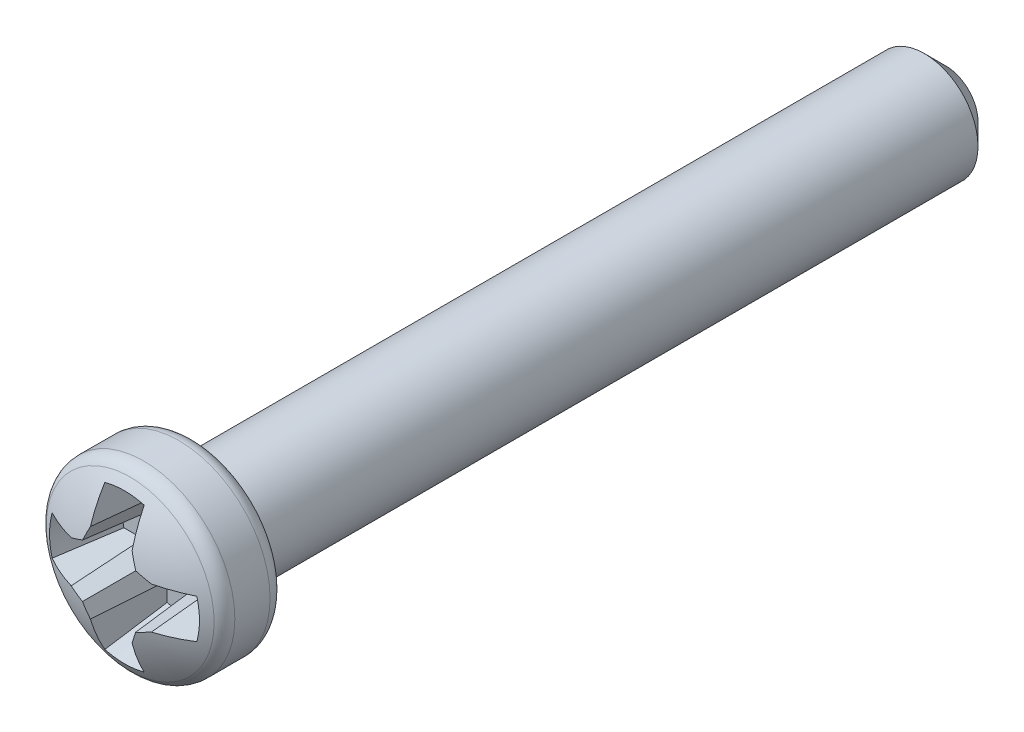
ISO-10303-21;
HEADER;
FILE_DESCRIPTION(('STEP AP214'),'2;1');
FILE_NAME('part.step','',(''),(''),'','','');
FILE_SCHEMA(('AUTOMOTIVE_DESIGN { 1 0 10303 214 1 1 1 1 }'));
ENDSEC;
DATA;
#1=APPLICATION_CONTEXT('core data for automotive mechanical design processes');
#2=APPLICATION_PROTOCOL_DEFINITION('international standard','automotive_design',2000,#1);
#3=PRODUCT_CONTEXT('',#1,'mechanical');
#4=PRODUCT('Part','Part','',(#3));
#5=PRODUCT_RELATED_PRODUCT_CATEGORY('part','',(#4));
#6=PRODUCT_DEFINITION_FORMATION('','',#4);
#7=PRODUCT_DEFINITION_CONTEXT('part definition',#1,'design');
#8=PRODUCT_DEFINITION('design','',#6,#7);
#9=PRODUCT_DEFINITION_SHAPE('','',#8);
#10=(LENGTH_UNIT() NAMED_UNIT(*) SI_UNIT(.MILLI.,.METRE.));
#11=(NAMED_UNIT(*) PLANE_ANGLE_UNIT() SI_UNIT($,.RADIAN.));
#12=(NAMED_UNIT(*) SI_UNIT($,.STERADIAN.) SOLID_ANGLE_UNIT());
#13=UNCERTAINTY_MEASURE_WITH_UNIT(LENGTH_MEASURE(1.E-05),#10,'distance_accuracy_value','');
#14=(GEOMETRIC_REPRESENTATION_CONTEXT(3) GLOBAL_UNCERTAINTY_ASSIGNED_CONTEXT((#13)) GLOBAL_UNIT_ASSIGNED_CONTEXT((#10,
#11,#12)) REPRESENTATION_CONTEXT('',''));
#15=CARTESIAN_POINT('',(0.,0.,0.));
#16=DIRECTION('',(0.,0.,1.));
#17=DIRECTION('',(1.,0.,0.));
#18=AXIS2_PLACEMENT_3D('',#15,#16,#17);
#19=CARTESIAN_POINT('',(-0.400000000000011,0.,15.7));
#20=DIRECTION('',(0.996194698091745,0.,0.0871557427476592));
#21=DIRECTION('',(0.,-1.,-1.20531199141214E-13));
#22=AXIS2_PLACEMENT_3D('',#19,#20,#21);
#23=PLANE('',#22);
#24=CARTESIAN_POINT('',(-0.155769339122426,0.,12.9084307722313));
#25=DIRECTION('',(0.996194698091745,0.,0.0871557427476592));
#26=DIRECTION('',(0.0871557427476592,0.,-0.996194698091745));
#27=AXIS2_PLACEMENT_3D('',#24,#25,#26);
#28=CIRCLE('',#27,2.77353697814506);
#29=CARTESIAN_POINT('',(-0.366942453606423,1.34976675197879,15.3221505157205));
#30=VERTEX_POINT('',#29);
#31=CARTESIAN_POINT('',(-0.388548913673451,0.747722237309709,15.5691134843641));
#32=VERTEX_POINT('',#31);
#33=EDGE_CURVE('E339',#30,#32,#28,.T.);
#34=ORIENTED_EDGE('',*,*,#33,.T.);
#35=DIRECTION('',(-0.0871426484044404,0.0173337504938601,0.996045029063886));
#36=VECTOR('',#35,1.);
#37=CARTESIAN_POINT('',(-0.400815427513501,0.750162198617128,15.7093203791284));
#38=LINE('',#37,#36);
#39=CARTESIAN_POINT('',(-0.273578881205041,0.724853275973701,14.255));
#40=VERTEX_POINT('',#39);
#41=EDGE_CURVE('E11',#40,#32,#38,.T.);
#42=ORIENTED_EDGE('',*,*,#41,.F.);
#43=DIRECTION('',(0.,-1.,0.));
#44=VECTOR('',#43,1.);
#45=CARTESIAN_POINT('',(-0.273578881205049,0.,14.255));
#46=LINE('',#45,#44);
#47=CARTESIAN_POINT('',(-0.273578881205038,1.07866041768189,14.255));
#48=VERTEX_POINT('',#47);
#49=EDGE_CURVE('E266',#48,#40,#46,.T.);
#50=ORIENTED_EDGE('',*,*,#49,.F.);
#51=CARTESIAN_POINT('',(-0.273578881205038,1.07866041768189,14.255));
#52=CARTESIAN_POINT('',(-0.304698622172029,1.16909490040446,14.6107002669011));
#53=CARTESIAN_POINT('',(-0.335820104838195,1.25945048805327,14.9664204415149));
#54=CARTESIAN_POINT('',(-0.366942453606423,1.34976675197879,15.3221505157205));
#55=(BOUNDED_CURVE() B_SPLINE_CURVE(3,(#51,#52,#53,#54),.UNSPECIFIED.,.F.,
.F.) B_SPLINE_CURVE_WITH_KNOTS((4,4),(0.0101147351762878,0.0112197354916044),
.UNSPECIFIED.) CURVE() GEOMETRIC_REPRESENTATION_ITEM() RATIONAL_B_SPLINE_CURVE((1.,1.,1.,1.)) REPRESENTATION_ITEM(''));
#56=EDGE_CURVE('E352',#48,#30,#55,.T.);
#57=ORIENTED_EDGE('',*,*,#56,.T.);
#58=EDGE_LOOP('',(#34,#42,#50,#57));
#59=FACE_BOUND('',#58,.T.);
#60=ADVANCED_FACE('F16',(#59),#23,.T.);
#61=CARTESIAN_POINT('',(-0.606586399182272,0.251256313292342,15.7));
#62=DIRECTION('',(0.920363891963223,-0.381227206369657,0.0871557427476588));
#63=DIRECTION('',(0.,-0.222868776578235,-0.974848454082234));
#64=AXIS2_PLACEMENT_3D('',#61,#62,#63);
#65=PLANE('',#64);
#66=CARTESIAN_POINT('',(-0.379146146396833,0.157047475959057,12.8861548030787));
#67=DIRECTION('',(0.920363891963223,-0.381227206369658,0.0871557427476588));
#68=DIRECTION('',(0.382683432365094,0.923879532511285,0.));
#69=AXIS2_PLACEMENT_3D('',#66,#67,#68);
#70=CIRCLE('',#69,2.74722630506);
#71=CARTESIAN_POINT('',(-0.496473166513852,0.496473166513839,15.6098062018733));
#72=VERTEX_POINT('',#71);
#73=EDGE_CURVE('E342',#32,#72,#70,.T.);
#74=ORIENTED_EDGE('',*,*,#73,.T.);
#75=DIRECTION('',(-0.0666626913468326,0.0666626913468326,0.995546167269401));
#76=VECTOR('',#75,1.);
#77=CARTESIAN_POINT('',(-0.5018585599701,0.501858559970086,15.6902321148732));
#78=LINE('',#77,#76);
#79=CARTESIAN_POINT('',(-0.405754091256932,0.405754091256919,14.255));
#80=VERTEX_POINT('',#79);
#81=EDGE_CURVE('E27',#80,#72,#78,.T.);
#82=ORIENTED_EDGE('',*,*,#81,.F.);
#83=DIRECTION('',(-0.382683432365094,-0.923879532511285,0.));
#84=VECTOR('',#83,1.);
#85=CARTESIAN_POINT('',(-0.489788515050423,0.202877045628466,14.255));
#86=LINE('',#85,#84);
#87=EDGE_CURVE('E262',#40,#80,#86,.T.);
#88=ORIENTED_EDGE('',*,*,#87,.F.);
#89=ORIENTED_EDGE('',*,*,#41,.T.);
#90=EDGE_LOOP('',(#74,#82,#88,#89));
#91=FACE_BOUND('',#90,.T.);
#92=ADVANCED_FACE('F18',(#91),#65,.T.);
#93=CARTESIAN_POINT('',(-0.251256313292353,0.606586399182252,15.7));
#94=DIRECTION('',(0.381227206369636,-0.920363891963232,0.0871557427476579));
#95=DIRECTION('',(0.,-0.0942752822069807,-0.995546167269401));
#96=AXIS2_PLACEMENT_3D('',#93,#94,#95);
#97=PLANE('',#96);
#98=CARTESIAN_POINT('',(-0.157047475959054,0.379146146396823,12.8861548030787));
#99=DIRECTION('',(0.381227206369636,-0.920363891963232,0.0871557427476579));
#100=DIRECTION('',(0.923879532511294,0.382683432365072,0.));
#101=AXIS2_PLACEMENT_3D('',#98,#99,#100);
#102=CIRCLE('',#101,2.74722630506);
#103=CARTESIAN_POINT('',(-0.747722237309725,0.388548913673444,15.5691134843641));
#104=VERTEX_POINT('',#103);
#105=EDGE_CURVE('E296',#72,#104,#102,.T.);
#106=ORIENTED_EDGE('',*,*,#105,.T.);
#107=DIRECTION('',(-0.0173337504938597,0.087142648404439,0.996045029063886));
#108=VECTOR('',#107,1.);
#109=CARTESIAN_POINT('',(-0.74977465582037,0.398867118306383,15.6870511029892));
#110=LINE('',#109,#108);
#111=CARTESIAN_POINT('',(-0.724853275973718,0.273578881205036,14.255));
#112=VERTEX_POINT('',#111);
#113=EDGE_CURVE('E335',#112,#104,#110,.T.);
#114=ORIENTED_EDGE('',*,*,#113,.F.);
#115=DIRECTION('',(-0.923879532511294,-0.382683432365072,0.));
#116=VECTOR('',#115,1.);
#117=CARTESIAN_POINT('',(-0.20287704562845,0.489788515050416,14.255));
#118=LINE('',#117,#116);
#119=EDGE_CURVE('E265',#80,#112,#118,.T.);
#120=ORIENTED_EDGE('',*,*,#119,.F.);
#121=ORIENTED_EDGE('',*,*,#81,.T.);
#122=EDGE_LOOP('',(#106,#114,#120,#121));
#123=FACE_BOUND('',#122,.T.);
#124=ADVANCED_FACE('F487',(#123),#97,.T.);
#125=CARTESIAN_POINT('',(0.,0.399999999999987,15.7));
#126=DIRECTION('',(0.,-0.996194698091746,0.0871557427476576));
#127=DIRECTION('',(-1.,0.,0.));
#128=AXIS2_PLACEMENT_3D('',#125,#126,#127);
#129=PLANE('',#128);
#130=CARTESIAN_POINT('',(0.,0.155769339122407,12.9084307722313));
#131=DIRECTION('',(0.,-0.996194698091746,0.0871557427476576));
#132=DIRECTION('',(0.,-0.0871557427476576,-0.996194698091746));
#133=AXIS2_PLACEMENT_3D('',#130,#131,#132);
#134=CIRCLE('',#133,2.77353697814506);
#135=CARTESIAN_POINT('',(-1.3497667519788,0.366942453606429,15.3221505157205));
#136=VERTEX_POINT('',#135);
#137=EDGE_CURVE('E281',#104,#136,#134,.T.);
#138=ORIENTED_EDGE('',*,*,#137,.T.);
#139=CARTESIAN_POINT('',(-1.07866041768188,0.273578881205039,14.255));
#140=CARTESIAN_POINT('',(-1.16909490040445,0.304698622172032,14.6107002669011));
#141=CARTESIAN_POINT('',(-1.25945048805327,0.335820104838199,14.9664204415149));
#142=CARTESIAN_POINT('',(-1.3497667519788,0.366942453606429,15.3221505157205));
#143=(BOUNDED_CURVE() B_SPLINE_CURVE(3,(#139,#140,#141,#142),.UNSPECIFIED.,.F.,
.F.) B_SPLINE_CURVE_WITH_KNOTS((4,4),(0.00303333154714993,0.00413833274330227),
.UNSPECIFIED.) CURVE() GEOMETRIC_REPRESENTATION_ITEM() RATIONAL_B_SPLINE_CURVE((1.,1.,1.,1.)) REPRESENTATION_ITEM(''));
#144=CARTESIAN_POINT('',(-1.07866041768188,0.273578881205039,14.255));
#145=VERTEX_POINT('',#144);
#146=EDGE_CURVE('E361',#145,#136,#143,.T.);
#147=ORIENTED_EDGE('',*,*,#146,.F.);
#148=DIRECTION('',(-1.,0.,0.));
#149=VECTOR('',#148,1.);
#150=CARTESIAN_POINT('',(0.,0.273578881205028,14.255));
#151=LINE('',#150,#149);
#152=EDGE_CURVE('E381',#112,#145,#151,.T.);
#153=ORIENTED_EDGE('',*,*,#152,.F.);
#154=ORIENTED_EDGE('',*,*,#113,.T.);
#155=EDGE_LOOP('',(#138,#147,#153,#154));
#156=FACE_BOUND('',#155,.T.);
#157=ADVANCED_FACE('F502',(#156),#129,.T.);
#158=CARTESIAN_POINT('',(0.,0.,15.7));
#159=DIRECTION('',(0.,0.,1.));
#160=DIRECTION('',(-1.,0.,0.));
#161=AXIS2_PLACEMENT_3D('',#158,#159,#160);
#162=CONICAL_SURFACE('',#161,1.5,0.26179938779915);
#163=CARTESIAN_POINT('',(0.,0.,15.3221505157205));
#164=DIRECTION('',(0.,0.,1.));
#165=DIRECTION('',(-1.,0.,0.));
#166=AXIS2_PLACEMENT_3D('',#163,#164,#165);
#167=CIRCLE('',#166,1.39875553582679);
#168=CARTESIAN_POINT('',(-1.3497667519788,-0.36694245360644,15.3221505157205));
#169=VERTEX_POINT('',#168);
#170=EDGE_CURVE('E270',#136,#169,#167,.T.);
#171=ORIENTED_EDGE('',*,*,#170,.T.);
#172=CARTESIAN_POINT('',(-1.07866041768189,-0.273578881205053,14.255));
#173=CARTESIAN_POINT('',(-1.16909490040446,-0.304698622172045,14.6107002669011));
#174=CARTESIAN_POINT('',(-1.25945048805328,-0.335820104838211,14.9664204415149));
#175=CARTESIAN_POINT('',(-1.3497667519788,-0.36694245360644,15.3221505157205));
#176=(BOUNDED_CURVE() B_SPLINE_CURVE(3,(#172,#173,#174,#175),.UNSPECIFIED.,.F.,
.F.) B_SPLINE_CURVE_WITH_KNOTS((4,4),(0.0101147351762878,0.0112197354916044),
.UNSPECIFIED.) CURVE() GEOMETRIC_REPRESENTATION_ITEM() RATIONAL_B_SPLINE_CURVE((1.,1.,1.,1.)) REPRESENTATION_ITEM(''));
#177=CARTESIAN_POINT('',(-1.07866041768189,-0.273578881205053,14.255));
#178=VERTEX_POINT('',#177);
#179=EDGE_CURVE('E353',#178,#169,#176,.T.);
#180=ORIENTED_EDGE('',*,*,#179,.F.);
#181=CARTESIAN_POINT('',(0.,0.,14.255));
#182=DIRECTION('',(0.,0.,1.));
#183=DIRECTION('',(1.,0.,0.));
#184=AXIS2_PLACEMENT_3D('',#181,#182,#183);
#185=CIRCLE('',#184,1.11281341693703);
#186=EDGE_CURVE('E385',#145,#178,#185,.T.);
#187=ORIENTED_EDGE('',*,*,#186,.F.);
#188=ORIENTED_EDGE('',*,*,#146,.T.);
#189=EDGE_LOOP('',(#171,#180,#187,#188));
#190=FACE_BOUND('',#189,.T.);
#191=ADVANCED_FACE('F497',(#190),#162,.F.);
#192=CARTESIAN_POINT('',(0.,-0.400000000000023,15.7));
#193=DIRECTION('',(0.,0.996194698091745,0.08715574274766));
#194=DIRECTION('',(1.,0.,0.));
#195=AXIS2_PLACEMENT_3D('',#192,#193,#194);
#196=PLANE('',#195);
#197=CARTESIAN_POINT('',(0.,-0.155769339122436,12.9084307722313));
#198=DIRECTION('',(0.,0.996194698091745,0.08715574274766));
#199=DIRECTION('',(0.,-0.08715574274766,0.996194698091745));
#200=AXIS2_PLACEMENT_3D('',#197,#198,#199);
#201=CIRCLE('',#200,2.77353697814506);
#202=CARTESIAN_POINT('',(-0.74772223730972,-0.388548913673466,15.5691134843641));
#203=VERTEX_POINT('',#202);
#204=EDGE_CURVE('E267',#169,#203,#201,.T.);
#205=ORIENTED_EDGE('',*,*,#204,.T.);
#206=DIRECTION('',(-0.0173337504938606,-0.0871426484044413,0.996045029063886));
#207=VECTOR('',#206,1.);
#208=CARTESIAN_POINT('',(-0.75016219861714,-0.400815427513517,15.7093203791284));
#209=LINE('',#208,#207);
#210=CARTESIAN_POINT('',(-0.724853275973712,-0.273578881205055,14.255));
#211=VERTEX_POINT('',#210);
#212=EDGE_CURVE('E362',#211,#203,#209,.T.);
#213=ORIENTED_EDGE('',*,*,#212,.F.);
#214=DIRECTION('',(1.,0.,0.));
#215=VECTOR('',#214,1.);
#216=CARTESIAN_POINT('',(0.,-0.27357888120506,14.255));
#217=LINE('',#216,#215);
#218=EDGE_CURVE('E560',#178,#211,#217,.T.);
#219=ORIENTED_EDGE('',*,*,#218,.F.);
#220=ORIENTED_EDGE('',*,*,#179,.T.);
#221=EDGE_LOOP('',(#205,#213,#219,#220));
#222=FACE_BOUND('',#221,.T.);
#223=ADVANCED_FACE('F607',(#222),#196,.T.);
#224=CARTESIAN_POINT('',(-0.251256313292352,-0.606586399182285,15.7));
#225=DIRECTION('',(0.381227206369654,0.920363891963224,0.0871557427476598));
#226=DIRECTION('',(0.22286877657824,0.,-0.974848454082233));
#227=AXIS2_PLACEMENT_3D('',#224,#225,#226);
#228=PLANE('',#227);
#229=CARTESIAN_POINT('',(-0.157047475959065,-0.379146146396845,12.8861548030787));
#230=DIRECTION('',(0.381227206369653,0.920363891963224,0.0871557427476598));
#231=DIRECTION('',(-0.923879532511287,0.38268343236509,0.));
#232=AXIS2_PLACEMENT_3D('',#229,#230,#231);
#233=CIRCLE('',#232,2.74722630506);
#234=CARTESIAN_POINT('',(-0.49647316651385,-0.496473166513867,15.6098062018733));
#235=VERTEX_POINT('',#234);
#236=EDGE_CURVE('E271',#203,#235,#233,.T.);
#237=ORIENTED_EDGE('',*,*,#236,.T.);
#238=DIRECTION('',(-0.0666626913468331,-0.0666626913468336,0.995546167269401));
#239=VECTOR('',#238,1.);
#240=CARTESIAN_POINT('',(-0.501858559970097,-0.501858559970114,15.6902321148732));
#241=LINE('',#240,#239);
#242=CARTESIAN_POINT('',(-0.405754091256929,-0.405754091256945,14.255));
#243=VERTEX_POINT('',#242);
#244=EDGE_CURVE('E433',#243,#235,#241,.T.);
#245=ORIENTED_EDGE('',*,*,#244,.F.);
#246=DIRECTION('',(0.923879532511287,-0.38268343236509,0.));
#247=VECTOR('',#246,1.);
#248=CARTESIAN_POINT('',(-0.20287704562847,-0.489788515050438,14.255));
#249=LINE('',#248,#247);
#250=EDGE_CURVE('E410',#211,#243,#249,.T.);
#251=ORIENTED_EDGE('',*,*,#250,.F.);
#252=ORIENTED_EDGE('',*,*,#212,.T.);
#253=EDGE_LOOP('',(#237,#245,#251,#252));
#254=FACE_BOUND('',#253,.T.);
#255=ADVANCED_FACE('F596',(#254),#228,.T.);
#256=CARTESIAN_POINT('',(-0.606586399182264,-0.251256313292368,15.7));
#257=DIRECTION('',(0.920363891963231,0.381227206369638,0.087155742747659));
#258=DIRECTION('',(0.,0.222868776578246,-0.974848454082231));
#259=AXIS2_PLACEMENT_3D('',#256,#257,#258);
#260=PLANE('',#259);
#261=CARTESIAN_POINT('',(-0.379146146396833,-0.157047475959064,12.8861548030787));
#262=DIRECTION('',(0.92036389196323,0.381227206369639,0.087155742747659));
#263=DIRECTION('',(-0.382683432365075,0.923879532511293,0.));
#264=AXIS2_PLACEMENT_3D('',#261,#262,#263);
#265=CIRCLE('',#264,2.74722630506);
#266=CARTESIAN_POINT('',(-0.388548913673453,-0.747722237309739,15.5691134843641));
#267=VERTEX_POINT('',#266);
#268=EDGE_CURVE('E284',#235,#267,#265,.T.);
#269=ORIENTED_EDGE('',*,*,#268,.T.);
#270=DIRECTION('',(-0.0871426484044398,-0.0173337504938608,0.996045029063886));
#271=VECTOR('',#270,1.);
#272=CARTESIAN_POINT('',(-0.398867118306393,-0.749774655820384,15.6870511029892));
#273=LINE('',#272,#271);
#274=CARTESIAN_POINT('',(-0.273578881205045,-0.724853275973731,14.255));
#275=VERTEX_POINT('',#274);
#276=EDGE_CURVE('E434',#275,#267,#273,.T.);
#277=ORIENTED_EDGE('',*,*,#276,.F.);
#278=DIRECTION('',(0.382683432365075,-0.923879532511293,0.));
#279=VECTOR('',#278,1.);
#280=CARTESIAN_POINT('',(-0.48978851505043,-0.202877045628457,14.255));
#281=LINE('',#280,#279);
#282=EDGE_CURVE('E209',#243,#275,#281,.T.);
#283=ORIENTED_EDGE('',*,*,#282,.F.);
#284=ORIENTED_EDGE('',*,*,#244,.T.);
#285=EDGE_LOOP('',(#269,#277,#283,#284));
#286=FACE_BOUND('',#285,.T.);
#287=ADVANCED_FACE('F598',(#286),#260,.T.);
#288=CARTESIAN_POINT('',(-0.4,0.,15.7));
#289=DIRECTION('',(0.996194698091746,0.,0.0871557427476584));
#290=DIRECTION('',(0.,-1.,0.));
#291=AXIS2_PLACEMENT_3D('',#288,#289,#290);
#292=PLANE('',#291);
#293=CARTESIAN_POINT('',(-0.155769339122418,0.,12.9084307722313));
#294=DIRECTION('',(0.996194698091746,0.,0.0871557427476584));
#295=DIRECTION('',(0.0871557427476584,0.,-0.996194698091746));
#296=AXIS2_PLACEMENT_3D('',#293,#294,#295);
#297=CIRCLE('',#296,2.77353697814506);
#298=CARTESIAN_POINT('',(-0.366942453606437,-1.34976675197881,15.3221505157205));
#299=VERTEX_POINT('',#298);
#300=EDGE_CURVE('E218',#267,#299,#297,.T.);
#301=ORIENTED_EDGE('',*,*,#300,.T.);
#302=CARTESIAN_POINT('',(-0.273578881205047,-1.07866041768189,14.255));
#303=CARTESIAN_POINT('',(-0.304698622172039,-1.16909490040447,14.6107002669011));
#304=CARTESIAN_POINT('',(-0.335820104838207,-1.25945048805328,14.9664204415149));
#305=CARTESIAN_POINT('',(-0.366942453606437,-1.34976675197881,15.3221505157205));
#306=(BOUNDED_CURVE() B_SPLINE_CURVE(3,(#302,#303,#304,#305),.UNSPECIFIED.,.F.,
.F.) B_SPLINE_CURVE_WITH_KNOTS((4,4),(0.00303333154714993,0.00413833274330227),
.UNSPECIFIED.) CURVE() GEOMETRIC_REPRESENTATION_ITEM() RATIONAL_B_SPLINE_CURVE((1.,1.,1.,1.)) REPRESENTATION_ITEM(''));
#307=CARTESIAN_POINT('',(-0.273578881205047,-1.07866041768189,14.255));
#308=VERTEX_POINT('',#307);
#309=EDGE_CURVE('E215',#308,#299,#306,.T.);
#310=ORIENTED_EDGE('',*,*,#309,.F.);
#311=DIRECTION('',(0.,-1.,0.));
#312=VECTOR('',#311,1.);
#313=CARTESIAN_POINT('',(-0.27357888120504,0.,14.255));
#314=LINE('',#313,#312);
#315=EDGE_CURVE('E201',#275,#308,#314,.T.);
#316=ORIENTED_EDGE('',*,*,#315,.F.);
#317=ORIENTED_EDGE('',*,*,#276,.T.);
#318=EDGE_LOOP('',(#301,#310,#316,#317));
#319=FACE_BOUND('',#318,.T.);
#320=ADVANCED_FACE('F216',(#319),#292,.T.);
#321=CARTESIAN_POINT('',(0.400000000000011,0.,15.7));
#322=DIRECTION('',(-0.996194698091745,0.,0.0871557427476592));
#323=DIRECTION('',(0.,1.,0.));
#324=AXIS2_PLACEMENT_3D('',#321,#322,#323);
#325=PLANE('',#324);
#326=CARTESIAN_POINT('',(0.155769339122426,0.,12.9084307722313));
#327=DIRECTION('',(-0.996194698091745,0.,0.0871557427476592));
#328=DIRECTION('',(0.0871557427476592,0.,0.996194698091745));
#329=AXIS2_PLACEMENT_3D('',#326,#327,#328);
#330=CIRCLE('',#329,2.77353697814506);
#331=CARTESIAN_POINT('',(0.366942453606433,-1.34976675197881,15.3221505157205));
#332=VERTEX_POINT('',#331);
#333=CARTESIAN_POINT('',(0.388548913673456,-0.747722237309731,15.5691134843641));
#334=VERTEX_POINT('',#333);
#335=EDGE_CURVE('E391',#332,#334,#330,.T.);
#336=ORIENTED_EDGE('',*,*,#335,.T.);
#337=DIRECTION('',(0.0871426484044404,-0.0173337504938611,0.996045029063886));
#338=VECTOR('',#337,1.);
#339=CARTESIAN_POINT('',(0.400815427513507,-0.750162198617151,15.7093203791284));
#340=LINE('',#339,#338);
#341=CARTESIAN_POINT('',(0.273578881205046,-0.724853275973723,14.255));
#342=VERTEX_POINT('',#341);
#343=EDGE_CURVE('E407',#342,#334,#340,.T.);
#344=ORIENTED_EDGE('',*,*,#343,.F.);
#345=DIRECTION('',(0.,1.,0.));
#346=VECTOR('',#345,1.);
#347=CARTESIAN_POINT('',(0.273578881205049,0.,14.255));
#348=LINE('',#347,#346);
#349=CARTESIAN_POINT('',(0.273578881205045,-1.0786604176819,14.255));
#350=VERTEX_POINT('',#349);
#351=EDGE_CURVE('E212',#350,#342,#348,.T.);
#352=ORIENTED_EDGE('',*,*,#351,.F.);
#353=CARTESIAN_POINT('',(0.273578881205045,-1.0786604176819,14.255));
#354=CARTESIAN_POINT('',(0.304698622172037,-1.16909490040448,14.6107002669011));
#355=CARTESIAN_POINT('',(0.335820104838204,-1.25945048805329,14.9664204415149));
#356=CARTESIAN_POINT('',(0.366942453606433,-1.34976675197881,15.3221505157205));
#357=(BOUNDED_CURVE() B_SPLINE_CURVE(3,(#353,#354,#355,#356),.UNSPECIFIED.,.F.,
.F.) B_SPLINE_CURVE_WITH_KNOTS((4,4),(0.0101147351762878,0.0112197354916044),
.UNSPECIFIED.) CURVE() GEOMETRIC_REPRESENTATION_ITEM() RATIONAL_B_SPLINE_CURVE((1.,1.,1.,1.)) REPRESENTATION_ITEM(''));
#358=EDGE_CURVE('E223',#350,#332,#357,.T.);
#359=ORIENTED_EDGE('',*,*,#358,.T.);
#360=EDGE_LOOP('',(#336,#344,#352,#359));
#361=FACE_BOUND('',#360,.T.);
#362=ADVANCED_FACE('F570',(#361),#325,.T.);
#363=CARTESIAN_POINT('',(0.606586399182273,-0.251256313292363,15.7));
#364=DIRECTION('',(-0.920363891963225,0.381227206369651,0.0871557427476594));
#365=DIRECTION('',(0.094275282206983,0.,0.995546167269401));
#366=AXIS2_PLACEMENT_3D('',#363,#364,#365);
#367=PLANE('',#366);
#368=CARTESIAN_POINT('',(0.379146146396836,-0.157047475959071,12.8861548030787));
#369=DIRECTION('',(-0.920363891963225,0.38122720636965,0.0871557427476594));
#370=DIRECTION('',(-0.382683432365087,-0.923879532511288,0.));
#371=AXIS2_PLACEMENT_3D('',#368,#369,#370);
#372=CIRCLE('',#371,2.74722630506);
#373=CARTESIAN_POINT('',(0.496473166513856,-0.496473166513861,15.6098062018733));
#374=VERTEX_POINT('',#373);
#375=EDGE_CURVE('E389',#334,#374,#372,.T.);
#376=ORIENTED_EDGE('',*,*,#375,.T.);
#377=DIRECTION('',(0.066662691346833,-0.0666626913468337,0.995546167269401));
#378=VECTOR('',#377,1.);
#379=CARTESIAN_POINT('',(0.501858559970103,-0.501858559970108,15.6902321148732));
#380=LINE('',#379,#378);
#381=CARTESIAN_POINT('',(0.405754091256935,-0.405754091256939,14.255));
#382=VERTEX_POINT('',#381);
#383=EDGE_CURVE('E41',#382,#374,#380,.T.);
#384=ORIENTED_EDGE('',*,*,#383,.F.);
#385=DIRECTION('',(0.382683432365087,0.923879532511288,0.));
#386=VECTOR('',#385,1.);
#387=CARTESIAN_POINT('',(0.489788515050433,-0.202877045628466,14.255));
#388=LINE('',#387,#386);
#389=EDGE_CURVE('E305',#342,#382,#388,.T.);
#390=ORIENTED_EDGE('',*,*,#389,.F.);
#391=ORIENTED_EDGE('',*,*,#343,.T.);
#392=EDGE_LOOP('',(#376,#384,#390,#391));
#393=FACE_BOUND('',#392,.T.);
#394=ADVANCED_FACE('F572',(#393),#367,.T.);
#395=CARTESIAN_POINT('',(0.251256313292357,-0.606586399182276,15.7));
#396=DIRECTION('',(-0.381227206369642,0.920363891963229,0.0871557427476594));
#397=DIRECTION('',(0.222868776578245,0.,0.974848454082231));
#398=AXIS2_PLACEMENT_3D('',#395,#396,#397);
#399=PLANE('',#398);
#400=CARTESIAN_POINT('',(0.157047475959058,-0.379146146396842,12.8861548030787));
#401=DIRECTION('',(-0.381227206369641,0.920363891963229,0.0871557427476594));
#402=DIRECTION('',(-0.923879532511292,-0.382683432365078,0.));
#403=AXIS2_PLACEMENT_3D('',#400,#401,#402);
#404=CIRCLE('',#403,2.74722630506);
#405=CARTESIAN_POINT('',(0.747722237309727,-0.388548913673463,15.5691134843641));
#406=VERTEX_POINT('',#405);
#407=EDGE_CURVE('E331',#374,#406,#404,.T.);
#408=ORIENTED_EDGE('',*,*,#407,.T.);
#409=DIRECTION('',(0.0173337504938603,-0.0871426484044405,0.996045029063886));
#410=VECTOR('',#409,1.);
#411=CARTESIAN_POINT('',(0.749774655820373,-0.398867118306403,15.6870511029892));
#412=LINE('',#411,#410);
#413=CARTESIAN_POINT('',(0.72485327597372,-0.273578881205054,14.255));
#414=VERTEX_POINT('',#413);
#415=EDGE_CURVE('E408',#414,#406,#412,.T.);
#416=ORIENTED_EDGE('',*,*,#415,.F.);
#417=DIRECTION('',(0.923879532511292,0.382683432365078,0.));
#418=VECTOR('',#417,1.);
#419=CARTESIAN_POINT('',(0.202877045628462,-0.489788515050434,14.255));
#420=LINE('',#419,#418);
#421=EDGE_CURVE('E452',#382,#414,#420,.T.);
#422=ORIENTED_EDGE('',*,*,#421,.F.);
#423=ORIENTED_EDGE('',*,*,#383,.T.);
#424=EDGE_LOOP('',(#408,#416,#422,#423));
#425=FACE_BOUND('',#424,.T.);
#426=ADVANCED_FACE('F627',(#425),#399,.T.);
#427=CARTESIAN_POINT('',(0.,-0.400000000000013,15.7));
#428=DIRECTION('',(0.,0.996194698091745,0.0871557427476592));
#429=DIRECTION('',(1.,0.,0.));
#430=AXIS2_PLACEMENT_3D('',#427,#428,#429);
#431=PLANE('',#430);
#432=CARTESIAN_POINT('',(0.,-0.155769339122428,12.9084307722313));
#433=DIRECTION('',(0.,0.996194698091745,0.0871557427476592));
#434=DIRECTION('',(0.,-0.0871557427476592,0.996194698091745));
#435=AXIS2_PLACEMENT_3D('',#432,#433,#434);
#436=CIRCLE('',#435,2.77353697814506);
#437=CARTESIAN_POINT('',(1.3497667519788,-0.366942453606444,15.3221505157205));
#438=VERTEX_POINT('',#437);
#439=EDGE_CURVE('E327',#406,#438,#436,.T.);
#440=ORIENTED_EDGE('',*,*,#439,.T.);
#441=CARTESIAN_POINT('',(1.07866041768188,-0.273578881205055,14.255));
#442=CARTESIAN_POINT('',(1.16909490040446,-0.304698622172047,14.6107002669011));
#443=CARTESIAN_POINT('',(1.25945048805327,-0.335820104838214,14.9664204415149));
#444=CARTESIAN_POINT('',(1.3497667519788,-0.366942453606444,15.3221505157205));
#445=(BOUNDED_CURVE() B_SPLINE_CURVE(3,(#441,#442,#443,#444),.UNSPECIFIED.,.F.,
.F.) B_SPLINE_CURVE_WITH_KNOTS((4,4),(0.00303333154714993,0.00413833274330227),
.UNSPECIFIED.) CURVE() GEOMETRIC_REPRESENTATION_ITEM() RATIONAL_B_SPLINE_CURVE((1.,1.,1.,1.)) REPRESENTATION_ITEM(''));
#446=CARTESIAN_POINT('',(1.07866041768188,-0.273578881205055,14.255));
#447=VERTEX_POINT('',#446);
#448=EDGE_CURVE('E240',#447,#438,#445,.T.);
#449=ORIENTED_EDGE('',*,*,#448,.F.);
#450=DIRECTION('',(1.,0.,0.));
#451=VECTOR('',#450,1.);
#452=CARTESIAN_POINT('',(0.,-0.273578881205051,14.255));
#453=LINE('',#452,#451);
#454=EDGE_CURVE('E315',#414,#447,#453,.T.);
#455=ORIENTED_EDGE('',*,*,#454,.F.);
#456=ORIENTED_EDGE('',*,*,#415,.T.);
#457=EDGE_LOOP('',(#440,#449,#455,#456));
#458=FACE_BOUND('',#457,.T.);
#459=ADVANCED_FACE('F624',(#458),#431,.T.);
#460=CARTESIAN_POINT('',(0.,0.,14.255));
#461=DIRECTION('',(0.,0.,1.));
#462=DIRECTION('',(1.,0.,0.));
#463=AXIS2_PLACEMENT_3D('',#460,#461,#462);
#464=PLANE('',#463);
#465=ORIENTED_EDGE('',*,*,#454,.T.);
#466=CARTESIAN_POINT('',(0.,0.,14.255));
#467=DIRECTION('',(0.,0.,1.));
#468=DIRECTION('',(1.,0.,0.));
#469=AXIS2_PLACEMENT_3D('',#466,#467,#468);
#470=CIRCLE('',#469,1.11281341693703);
#471=CARTESIAN_POINT('',(1.07866041768189,0.273578881205037,14.255));
#472=VERTEX_POINT('',#471);
#473=EDGE_CURVE('E246',#447,#472,#470,.T.);
#474=ORIENTED_EDGE('',*,*,#473,.T.);
#475=DIRECTION('',(-1.,0.,0.));
#476=VECTOR('',#475,1.);
#477=CARTESIAN_POINT('',(0.,0.273578881205037,14.255));
#478=LINE('',#477,#476);
#479=CARTESIAN_POINT('',(0.72485327597371,0.273578881205037,14.255));
#480=VERTEX_POINT('',#479);
#481=EDGE_CURVE('E312',#472,#480,#478,.T.);
#482=ORIENTED_EDGE('',*,*,#481,.T.);
#483=DIRECTION('',(-0.923879532511289,0.382683432365084,0.));
#484=VECTOR('',#483,1.);
#485=CARTESIAN_POINT('',(0.202877045628459,0.489788515050419,14.255));
#486=LINE('',#485,#484);
#487=CARTESIAN_POINT('',(0.405754091256926,0.405754091256924,14.255));
#488=VERTEX_POINT('',#487);
#489=EDGE_CURVE('E338',#480,#488,#486,.T.);
#490=ORIENTED_EDGE('',*,*,#489,.T.);
#491=DIRECTION('',(-0.382683432365081,0.92387953251129,0.));
#492=VECTOR('',#491,1.);
#493=CARTESIAN_POINT('',(0.48978851505042,0.202877045628457,14.255));
#494=LINE('',#493,#492);
#495=CARTESIAN_POINT('',(0.273578881205039,0.724853275973709,14.255));
#496=VERTEX_POINT('',#495);
#497=EDGE_CURVE('E301',#488,#496,#494,.T.);
#498=ORIENTED_EDGE('',*,*,#497,.T.);
#499=DIRECTION('',(0.,1.,0.));
#500=VECTOR('',#499,1.);
#501=CARTESIAN_POINT('',(0.27357888120504,0.,14.255));
#502=LINE('',#501,#500);
#503=CARTESIAN_POINT('',(0.273578881205039,1.07866041768189,14.255));
#504=VERTEX_POINT('',#503);
#505=EDGE_CURVE('E302',#496,#504,#502,.T.);
#506=ORIENTED_EDGE('',*,*,#505,.T.);
#507=CARTESIAN_POINT('',(0.,0.,14.255));
#508=DIRECTION('',(0.,0.,1.));
#509=DIRECTION('',(1.,0.,0.));
#510=AXIS2_PLACEMENT_3D('',#507,#508,#509);
#511=CIRCLE('',#510,1.11281341693703);
#512=EDGE_CURVE('E417',#504,#48,#511,.T.);
#513=ORIENTED_EDGE('',*,*,#512,.T.);
#514=ORIENTED_EDGE('',*,*,#49,.T.);
#515=ORIENTED_EDGE('',*,*,#87,.T.);
#516=ORIENTED_EDGE('',*,*,#119,.T.);
#517=ORIENTED_EDGE('',*,*,#152,.T.);
#518=ORIENTED_EDGE('',*,*,#186,.T.);
#519=ORIENTED_EDGE('',*,*,#218,.T.);
#520=ORIENTED_EDGE('',*,*,#250,.T.);
#521=ORIENTED_EDGE('',*,*,#282,.T.);
#522=ORIENTED_EDGE('',*,*,#315,.T.);
#523=CARTESIAN_POINT('',(0.,0.,14.255));
#524=DIRECTION('',(0.,0.,1.));
#525=DIRECTION('',(1.,0.,0.));
#526=AXIS2_PLACEMENT_3D('',#523,#524,#525);
#527=CIRCLE('',#526,1.11281341693703);
#528=EDGE_CURVE('E206',#308,#350,#527,.T.);
#529=ORIENTED_EDGE('',*,*,#528,.T.);
#530=ORIENTED_EDGE('',*,*,#351,.T.);
#531=ORIENTED_EDGE('',*,*,#389,.T.);
#532=ORIENTED_EDGE('',*,*,#421,.T.);
#533=EDGE_LOOP('',(#465,#474,#482,#490,#498,#506,#513,#514,#515,#516,#517,#518,#519,#520,#521,
#522,#529,#530,#531,#532));
#534=FACE_BOUND('',#533,.T.);
#535=ADVANCED_FACE('F203',(#534),#464,.T.);
#536=CARTESIAN_POINT('',(0.,0.4,15.7));
#537=DIRECTION('',(0.,-0.996194698091746,0.0871557427476584));
#538=DIRECTION('',(-1.,0.,0.));
#539=AXIS2_PLACEMENT_3D('',#536,#537,#538);
#540=PLANE('',#539);
#541=CARTESIAN_POINT('',(0.,0.155769339122415,12.9084307722313));
#542=DIRECTION('',(0.,-0.996194698091746,0.0871557427476584));
#543=DIRECTION('',(0.,-0.0871557427476584,-0.996194698091746));
#544=AXIS2_PLACEMENT_3D('',#541,#542,#543);
#545=CIRCLE('',#544,2.77353697814506);
#546=CARTESIAN_POINT('',(1.3497667519788,0.366942453606425,15.3221505157205));
#547=VERTEX_POINT('',#546);
#548=CARTESIAN_POINT('',(0.747722237309717,0.388548913673446,15.5691134843641));
#549=VERTEX_POINT('',#548);
#550=EDGE_CURVE('E537',#547,#549,#545,.T.);
#551=ORIENTED_EDGE('',*,*,#550,.T.);
#552=DIRECTION('',(0.0173337504938599,0.0871426484044397,0.996045029063886));
#553=VECTOR('',#552,1.);
#554=CARTESIAN_POINT('',(0.750162198617137,0.400815427513497,15.7093203791284));
#555=LINE('',#554,#553);
#556=EDGE_CURVE('E316',#480,#549,#555,.T.);
#557=ORIENTED_EDGE('',*,*,#556,.F.);
#558=ORIENTED_EDGE('',*,*,#481,.F.);
#559=CARTESIAN_POINT('',(1.07866041768189,0.273578881205037,14.255));
#560=CARTESIAN_POINT('',(1.16909490040446,0.304698622172029,14.6107002669011));
#561=CARTESIAN_POINT('',(1.25945048805327,0.335820104838196,14.9664204415149));
#562=CARTESIAN_POINT('',(1.3497667519788,0.366942453606425,15.3221505157205));
#563=(BOUNDED_CURVE() B_SPLINE_CURVE(3,(#559,#560,#561,#562),.UNSPECIFIED.,.F.,
.F.) B_SPLINE_CURVE_WITH_KNOTS((4,4),(0.0101147351762878,0.0112197354916044),
.UNSPECIFIED.) CURVE() GEOMETRIC_REPRESENTATION_ITEM() RATIONAL_B_SPLINE_CURVE((1.,1.,1.,1.)) REPRESENTATION_ITEM(''));
#564=EDGE_CURVE('E245',#472,#547,#563,.T.);
#565=ORIENTED_EDGE('',*,*,#564,.T.);
#566=EDGE_LOOP('',(#551,#557,#558,#565));
#567=FACE_BOUND('',#566,.T.);
#568=ADVANCED_FACE('F534',(#567),#540,.T.);
#569=CARTESIAN_POINT('',(0.251256313292348,0.606586399182262,15.7));
#570=DIRECTION('',(-0.381227206369648,-0.920363891963227,0.0871557427476584));
#571=DIRECTION('',(-0.923879532511289,0.382683432365084,0.));
#572=AXIS2_PLACEMENT_3D('',#569,#570,#571);
#573=PLANE('',#572);
#574=CARTESIAN_POINT('',(0.157047475959061,0.379146146396826,12.8861548030787));
#575=DIRECTION('',(-0.381227206369648,-0.920363891963227,0.0871557427476584));
#576=DIRECTION('',(0.923879532511289,-0.382683432365084,0.));
#577=AXIS2_PLACEMENT_3D('',#574,#575,#576);
#578=CIRCLE('',#577,2.74722630506);
#579=CARTESIAN_POINT('',(0.496473166513847,0.496473166513845,15.6098062018733));
#580=VERTEX_POINT('',#579);
#581=EDGE_CURVE('E326',#549,#580,#578,.T.);
#582=ORIENTED_EDGE('',*,*,#581,.T.);
#583=DIRECTION('',(0.0666626913468327,0.0666626913468325,0.995546167269401));
#584=VECTOR('',#583,1.);
#585=CARTESIAN_POINT('',(0.501858559970094,0.501858559970092,15.6902321148732));
#586=LINE('',#585,#584);
#587=EDGE_CURVE('E344',#488,#580,#586,.T.);
#588=ORIENTED_EDGE('',*,*,#587,.F.);
#589=ORIENTED_EDGE('',*,*,#489,.F.);
#590=ORIENTED_EDGE('',*,*,#556,.T.);
#591=EDGE_LOOP('',(#582,#588,#589,#590));
#592=FACE_BOUND('',#591,.T.);
#593=ADVANCED_FACE('F631',(#592),#573,.T.);
#594=CARTESIAN_POINT('',(0.606586399182262,0.251256313292347,15.7));
#595=DIRECTION('',(-0.920363891963228,-0.381227206369645,0.0871557427476583));
#596=DIRECTION('',(-0.382683432365081,0.92387953251129,0.));
#597=AXIS2_PLACEMENT_3D('',#594,#595,#596);
#598=PLANE('',#597);
#599=CARTESIAN_POINT('',(0.37914614639683,0.15704747595905,12.8861548030787));
#600=DIRECTION('',(-0.920363891963228,-0.381227206369645,0.0871557427476583));
#601=DIRECTION('',(0.382683432365081,-0.92387953251129,0.));
#602=AXIS2_PLACEMENT_3D('',#599,#600,#601);
#603=CIRCLE('',#602,2.74722630506);
#604=CARTESIAN_POINT('',(0.388548913673448,0.747722237309716,15.5691134843641));
#605=VERTEX_POINT('',#604);
#606=EDGE_CURVE('E310',#580,#605,#603,.T.);
#607=ORIENTED_EDGE('',*,*,#606,.T.);
#608=DIRECTION('',(0.0871426484044397,0.0173337504938598,0.996045029063886));
#609=VECTOR('',#608,1.);
#610=CARTESIAN_POINT('',(0.398867118306387,0.749774655820362,15.6870511029892));
#611=LINE('',#610,#609);
#612=EDGE_CURVE('E298',#496,#605,#611,.T.);
#613=ORIENTED_EDGE('',*,*,#612,.F.);
#614=ORIENTED_EDGE('',*,*,#497,.F.);
#615=ORIENTED_EDGE('',*,*,#587,.T.);
#616=EDGE_LOOP('',(#607,#613,#614,#615));
#617=FACE_BOUND('',#616,.T.);
#618=ADVANCED_FACE('F640',(#617),#598,.T.);
#619=CARTESIAN_POINT('',(0.4,0.,15.7));
#620=DIRECTION('',(-0.996194698091746,0.,0.0871557427476584));
#621=DIRECTION('',(0.,1.,0.));
#622=AXIS2_PLACEMENT_3D('',#619,#620,#621);
#623=PLANE('',#622);
#624=CARTESIAN_POINT('',(0.155769339122418,0.,12.9084307722313));
#625=DIRECTION('',(-0.996194698091746,0.,0.0871557427476584));
#626=DIRECTION('',(0.0871557427476584,0.,0.996194698091746));
#627=AXIS2_PLACEMENT_3D('',#624,#625,#626);
#628=CIRCLE('',#627,2.77353697814506);
#629=CARTESIAN_POINT('',(0.366942453606427,1.34976675197879,15.3221505157205));
#630=VERTEX_POINT('',#629);
#631=EDGE_CURVE('E306',#605,#630,#628,.T.);
#632=ORIENTED_EDGE('',*,*,#631,.T.);
#633=CARTESIAN_POINT('',(0.273578881205039,1.07866041768189,14.255));
#634=CARTESIAN_POINT('',(0.304698622172031,1.16909490040446,14.6107002669011));
#635=CARTESIAN_POINT('',(0.335820104838198,1.25945048805327,14.9664204415149));
#636=CARTESIAN_POINT('',(0.366942453606427,1.34976675197879,15.3221505157205));
#637=(BOUNDED_CURVE() B_SPLINE_CURVE(3,(#633,#634,#635,#636),.UNSPECIFIED.,.F.,
.F.) B_SPLINE_CURVE_WITH_KNOTS((4,4),(0.00303333154714993,0.00413833274330227),
.UNSPECIFIED.) CURVE() GEOMETRIC_REPRESENTATION_ITEM() RATIONAL_B_SPLINE_CURVE((1.,1.,1.,1.)) REPRESENTATION_ITEM(''));
#638=EDGE_CURVE('E400',#504,#630,#637,.T.);
#639=ORIENTED_EDGE('',*,*,#638,.F.);
#640=ORIENTED_EDGE('',*,*,#505,.F.);
#641=ORIENTED_EDGE('',*,*,#612,.T.);
#642=EDGE_LOOP('',(#632,#639,#640,#641));
#643=FACE_BOUND('',#642,.T.);
#644=ADVANCED_FACE('F637',(#643),#623,.T.);
#645=CARTESIAN_POINT('',(0.,0.,15.7));
#646=DIRECTION('',(0.,0.,1.));
#647=DIRECTION('',(1.,0.,0.));
#648=AXIS2_PLACEMENT_3D('',#645,#646,#647);
#649=CONICAL_SURFACE('',#648,1.5,0.26179938779915);
#650=CARTESIAN_POINT('',(0.,0.,15.3221505157205));
#651=DIRECTION('',(0.,0.,1.));
#652=DIRECTION('',(-1.,0.,0.));
#653=AXIS2_PLACEMENT_3D('',#650,#651,#652);
#654=CIRCLE('',#653,1.39875553582679);
#655=EDGE_CURVE('E311',#630,#30,#654,.T.);
#656=ORIENTED_EDGE('',*,*,#655,.T.);
#657=ORIENTED_EDGE('',*,*,#56,.F.);
#658=ORIENTED_EDGE('',*,*,#512,.F.);
#659=ORIENTED_EDGE('',*,*,#638,.T.);
#660=EDGE_LOOP('',(#656,#657,#658,#659));
#661=FACE_BOUND('',#660,.T.);
#662=ADVANCED_FACE('F639',(#661),#649,.F.);
#663=CARTESIAN_POINT('',(0.,0.,15.7));
#664=DIRECTION('',(0.,0.,1.));
#665=DIRECTION('',(1.,0.,0.));
#666=AXIS2_PLACEMENT_3D('',#663,#664,#665);
#667=CONICAL_SURFACE('',#666,1.5,0.26179938779915);
#668=ORIENTED_EDGE('',*,*,#473,.F.);
#669=ORIENTED_EDGE('',*,*,#448,.T.);
#670=CARTESIAN_POINT('',(0.,0.,15.3221505157205));
#671=DIRECTION('',(0.,0.,1.));
#672=DIRECTION('',(-1.,0.,0.));
#673=AXIS2_PLACEMENT_3D('',#670,#671,#672);
#674=CIRCLE('',#673,1.39875553582679);
#675=EDGE_CURVE('E332',#438,#547,#674,.T.);
#676=ORIENTED_EDGE('',*,*,#675,.T.);
#677=ORIENTED_EDGE('',*,*,#564,.F.);
#678=EDGE_LOOP('',(#668,#669,#676,#677));
#679=FACE_BOUND('',#678,.T.);
#680=ADVANCED_FACE('F543',(#679),#667,.F.);
#681=CARTESIAN_POINT('',(0.,0.,15.7));
#682=DIRECTION('',(0.,0.,1.));
#683=DIRECTION('',(0.,-1.,0.));
#684=AXIS2_PLACEMENT_3D('',#681,#682,#683);
#685=CONICAL_SURFACE('',#684,1.5,0.26179938779915);
#686=ORIENTED_EDGE('',*,*,#528,.F.);
#687=ORIENTED_EDGE('',*,*,#309,.T.);
#688=CARTESIAN_POINT('',(0.,0.,15.3221505157205));
#689=DIRECTION('',(0.,0.,1.));
#690=DIRECTION('',(0.,1.,0.));
#691=AXIS2_PLACEMENT_3D('',#688,#689,#690);
#692=CIRCLE('',#691,1.39875553582679);
#693=EDGE_CURVE('E321',#299,#332,#692,.T.);
#694=ORIENTED_EDGE('',*,*,#693,.T.);
#695=ORIENTED_EDGE('',*,*,#358,.F.);
#696=EDGE_LOOP('',(#686,#687,#694,#695));
#697=FACE_BOUND('',#696,.T.);
#698=ADVANCED_FACE('F226',(#697),#685,.F.);
#699=CARTESIAN_POINT('',(0.,0.,14.));
#700=DIRECTION('',(0.,0.,-1.));
#701=DIRECTION('',(0.,-1.,0.));
#702=AXIS2_PLACEMENT_3D('',#699,#700,#701);
#703=PLANE('',#702);
#704=CARTESIAN_POINT('',(0.,0.,14.));
#705=DIRECTION('',(0.,0.,1.));
#706=DIRECTION('',(1.,0.,0.));
#707=AXIS2_PLACEMENT_3D('',#704,#705,#706);
#708=CIRCLE('',#707,1.);
#709=CARTESIAN_POINT('',(-1.,0.,14.));
#710=VERTEX_POINT('',#709);
#711=EDGE_CURVE('E379',#710,#710,#708,.T.);
#712=ORIENTED_EDGE('',*,*,#711,.T.);
#713=EDGE_LOOP('',(#712));
#714=FACE_BOUND('',#713,.T.);
#715=CARTESIAN_POINT('',(0.,0.,14.));
#716=DIRECTION('',(0.,0.,1.));
#717=DIRECTION('',(-1.,0.,0.));
#718=AXIS2_PLACEMENT_3D('',#715,#716,#717);
#719=CIRCLE('',#718,1.394);
#720=CARTESIAN_POINT('',(-1.394,0.,14.));
#721=VERTEX_POINT('',#720);
#722=EDGE_CURVE('E228',#721,#721,#719,.T.);
#723=ORIENTED_EDGE('',*,*,#722,.F.);
#724=EDGE_LOOP('',(#723));
#725=FACE_BOUND('',#724,.T.);
#726=ADVANCED_FACE('F635',(#714,#725),#703,.T.);
#727=CARTESIAN_POINT('',(0.,0.,14.306));
#728=DIRECTION('',(0.,0.,1.));
#729=DIRECTION('',(1.,0.,0.));
#730=AXIS2_PLACEMENT_3D('',#727,#728,#729);
#731=TOROIDAL_SURFACE('',#730,1.394,0.306);
#732=CARTESIAN_POINT('',(0.,0.,14.306));
#733=DIRECTION('',(0.,0.,-1.));
#734=DIRECTION('',(-1.,0.,0.));
#735=AXIS2_PLACEMENT_3D('',#732,#733,#734);
#736=CIRCLE('',#735,1.7);
#737=CARTESIAN_POINT('',(1.7,0.,14.306));
#738=VERTEX_POINT('',#737);
#739=CARTESIAN_POINT('',(-1.7,0.,14.306));
#740=VERTEX_POINT('',#739);
#741=EDGE_CURVE('E247',#738,#740,#736,.T.);
#742=ORIENTED_EDGE('',*,*,#741,.T.);
#743=CARTESIAN_POINT('',(-1.394,0.,14.306));
#744=DIRECTION('',(0.,-1.,0.));
#745=DIRECTION('',(-1.,0.,0.));
#746=AXIS2_PLACEMENT_3D('',#743,#744,#745);
#747=CIRCLE('',#746,0.306);
#748=EDGE_CURVE('E234',#740,#721,#747,.T.);
#749=ORIENTED_EDGE('',*,*,#748,.T.);
#750=ORIENTED_EDGE('',*,*,#722,.T.);
#751=ORIENTED_EDGE('',*,*,#748,.F.);
#752=CARTESIAN_POINT('',(0.,0.,14.306));
#753=DIRECTION('',(0.,0.,-1.));
#754=DIRECTION('',(-1.,0.,0.));
#755=AXIS2_PLACEMENT_3D('',#752,#753,#754);
#756=CIRCLE('',#755,1.7);
#757=EDGE_CURVE('E20',#740,#738,#756,.T.);
#758=ORIENTED_EDGE('',*,*,#757,.T.);
#759=EDGE_LOOP('',(#742,#749,#750,#751,#758));
#760=FACE_BOUND('',#759,.T.);
#761=ADVANCED_FACE('F632',(#760),#731,.T.);
#762=CARTESIAN_POINT('',(0.,0.,12.9220588235294));
#763=DIRECTION('',(-1.,0.,0.));
#764=DIRECTION('',(0.,1.,0.));
#765=AXIS2_PLACEMENT_3D('',#762,#763,#764);
#766=SPHERICAL_SURFACE('',#765,2.7779411764706);
#767=ORIENTED_EDGE('',*,*,#655,.F.);
#768=ORIENTED_EDGE('',*,*,#631,.F.);
#769=ORIENTED_EDGE('',*,*,#606,.F.);
#770=ORIENTED_EDGE('',*,*,#581,.F.);
#771=ORIENTED_EDGE('',*,*,#550,.F.);
#772=ORIENTED_EDGE('',*,*,#675,.F.);
#773=ORIENTED_EDGE('',*,*,#439,.F.);
#774=ORIENTED_EDGE('',*,*,#407,.F.);
#775=ORIENTED_EDGE('',*,*,#375,.F.);
#776=ORIENTED_EDGE('',*,*,#335,.F.);
#777=ORIENTED_EDGE('',*,*,#693,.F.);
#778=ORIENTED_EDGE('',*,*,#300,.F.);
#779=ORIENTED_EDGE('',*,*,#268,.F.);
#780=ORIENTED_EDGE('',*,*,#236,.F.);
#781=ORIENTED_EDGE('',*,*,#204,.F.);
#782=ORIENTED_EDGE('',*,*,#170,.F.);
#783=ORIENTED_EDGE('',*,*,#137,.F.);
#784=ORIENTED_EDGE('',*,*,#105,.F.);
#785=ORIENTED_EDGE('',*,*,#73,.F.);
#786=ORIENTED_EDGE('',*,*,#33,.F.);
#787=EDGE_LOOP('',(#767,#768,#769,#770,#771,#772,#773,#774,#775,#776,#777,#778,#779,#780,#781,
#782,#783,#784,#785,#786));
#788=FACE_BOUND('',#787,.T.);
#789=CARTESIAN_POINT('',(0.,0.,15.2161467809123));
#790=DIRECTION('',(0.,0.,-1.));
#791=DIRECTION('',(-1.,0.,0.));
#792=AXIS2_PLACEMENT_3D('',#789,#790,#791);
#793=CIRCLE('',#792,1.56656235870833);
#794=CARTESIAN_POINT('',(1.56656235870833,0.,15.2161467809123));
#795=VERTEX_POINT('',#794);
#796=EDGE_CURVE('E255',#795,#795,#793,.T.);
#797=ORIENTED_EDGE('',*,*,#796,.F.);
#798=EDGE_LOOP('',(#797));
#799=FACE_BOUND('',#798,.T.);
#800=ADVANCED_FACE('F493',(#788,#799),#766,.T.);
#801=CARTESIAN_POINT('',(0.,0.,0.));
#802=DIRECTION('',(0.,0.,-1.));
#803=DIRECTION('',(-1.,0.,0.));
#804=AXIS2_PLACEMENT_3D('',#801,#802,#803);
#805=CYLINDRICAL_SURFACE('',#804,1.7);
#806=ORIENTED_EDGE('',*,*,#741,.F.);
#807=DIRECTION('',(0.,0.,1.));
#808=VECTOR('',#807,1.);
#809=CARTESIAN_POINT('',(1.7,0.,0.));
#810=LINE('',#809,#808);
#811=CARTESIAN_POINT('',(1.7,0.,14.9634449163425));
#812=VERTEX_POINT('',#811);
#813=EDGE_CURVE('E254',#738,#812,#810,.T.);
#814=ORIENTED_EDGE('',*,*,#813,.T.);
#815=CARTESIAN_POINT('',(0.,0.,14.9634449163425));
#816=DIRECTION('',(0.,0.,1.));
#817=DIRECTION('',(-1.,0.,0.));
#818=AXIS2_PLACEMENT_3D('',#815,#816,#817);
#819=CIRCLE('',#818,1.7);
#820=EDGE_CURVE('E256',#812,#812,#819,.T.);
#821=ORIENTED_EDGE('',*,*,#820,.F.);
#822=ORIENTED_EDGE('',*,*,#813,.F.);
#823=ORIENTED_EDGE('',*,*,#757,.F.);
#824=EDGE_LOOP('',(#806,#814,#821,#822,#823));
#825=FACE_BOUND('',#824,.T.);
#826=ADVANCED_FACE('F620',(#825),#805,.T.);
#827=CARTESIAN_POINT('',(0.,0.,14.9634449163425));
#828=DIRECTION('',(0.,0.,-1.));
#829=DIRECTION('',(-1.,0.,0.));
#830=AXIS2_PLACEMENT_3D('',#827,#828,#829);
#831=TOROIDAL_SURFACE('',#830,1.394,0.306);
#832=ORIENTED_EDGE('',*,*,#820,.T.);
#833=CARTESIAN_POINT('',(1.394,0.,14.9634449163425));
#834=DIRECTION('',(0.,-1.,0.));
#835=DIRECTION('',(1.,0.,0.));
#836=AXIS2_PLACEMENT_3D('',#833,#834,#835);
#837=CIRCLE('',#836,0.306);
#838=EDGE_CURVE('E260',#812,#795,#837,.T.);
#839=ORIENTED_EDGE('',*,*,#838,.T.);
#840=ORIENTED_EDGE('',*,*,#796,.T.);
#841=ORIENTED_EDGE('',*,*,#838,.F.);
#842=EDGE_LOOP('',(#832,#839,#840,#841));
#843=FACE_BOUND('',#842,.T.);
#844=ADVANCED_FACE('F651',(#843),#831,.T.);
#845=CARTESIAN_POINT('',(0.,0.,0.));
#846=DIRECTION('',(0.,0.,1.));
#847=DIRECTION('',(1.,0.,0.));
#848=AXIS2_PLACEMENT_3D('',#845,#846,#847);
#849=PLANE('',#848);
#850=CARTESIAN_POINT('',(0.,0.,0.));
#851=DIRECTION('',(0.,0.,1.));
#852=DIRECTION('',(-1.,0.,0.));
#853=AXIS2_PLACEMENT_3D('',#850,#851,#852);
#854=CIRCLE('',#853,0.6);
#855=CARTESIAN_POINT('',(0.6,0.,0.));
#856=VERTEX_POINT('',#855);
#857=EDGE_CURVE('E238',#856,#856,#854,.T.);
#858=ORIENTED_EDGE('',*,*,#857,.F.);
#859=EDGE_LOOP('',(#858));
#860=FACE_BOUND('',#859,.T.);
#861=ADVANCED_FACE('F656',(#860),#849,.F.);
#862=CARTESIAN_POINT('',(0.,0.,0.));
#863=DIRECTION('',(0.,0.,1.));
#864=DIRECTION('',(1.,0.,0.));
#865=AXIS2_PLACEMENT_3D('',#862,#863,#864);
#866=CYLINDRICAL_SURFACE('',#865,1.);
#867=ORIENTED_EDGE('',*,*,#711,.F.);
#868=DIRECTION('',(0.,0.,-1.));
#869=VECTOR('',#868,1.);
#870=CARTESIAN_POINT('',(-1.,0.,0.));
#871=LINE('',#870,#869);
#872=CARTESIAN_POINT('',(-1.,0.,0.4));
#873=VERTEX_POINT('',#872);
#874=EDGE_CURVE('E261',#710,#873,#871,.T.);
#875=ORIENTED_EDGE('',*,*,#874,.T.);
#876=CARTESIAN_POINT('',(0.,0.,0.4));
#877=DIRECTION('',(0.,0.,-1.));
#878=DIRECTION('',(-1.,0.,0.));
#879=AXIS2_PLACEMENT_3D('',#876,#877,#878);
#880=CIRCLE('',#879,1.);
#881=CARTESIAN_POINT('',(1.,0.,0.4));
#882=VERTEX_POINT('',#881);
#883=EDGE_CURVE('E380',#882,#873,#880,.T.);
#884=ORIENTED_EDGE('',*,*,#883,.F.);
#885=CARTESIAN_POINT('',(0.,0.,0.4));
#886=DIRECTION('',(0.,0.,-1.));
#887=DIRECTION('',(-1.,0.,0.));
#888=AXIS2_PLACEMENT_3D('',#885,#886,#887);
#889=CIRCLE('',#888,1.);
#890=EDGE_CURVE('E376',#873,#882,#889,.T.);
#891=ORIENTED_EDGE('',*,*,#890,.F.);
#892=ORIENTED_EDGE('',*,*,#874,.F.);
#893=EDGE_LOOP('',(#867,#875,#884,#891,#892));
#894=FACE_BOUND('',#893,.T.);
#895=ADVANCED_FACE('F883',(#894),#866,.T.);
#896=CARTESIAN_POINT('',(0.,0.,0.2));
#897=DIRECTION('',(0.,0.,1.));
#898=DIRECTION('',(-1.,0.,0.));
#899=AXIS2_PLACEMENT_3D('',#896,#897,#898);
#900=CONICAL_SURFACE('',#899,0.8,0.785398163397448);
#901=ORIENTED_EDGE('',*,*,#857,.T.);
#902=DIRECTION('',(0.707106781186547,0.,0.707106781186548));
#903=VECTOR('',#902,1.);
#904=CARTESIAN_POINT('',(0.8,0.,0.2));
#905=LINE('',#904,#903);
#906=EDGE_CURVE('E448',#856,#882,#905,.T.);
#907=ORIENTED_EDGE('',*,*,#906,.T.);
#908=ORIENTED_EDGE('',*,*,#883,.T.);
#909=ORIENTED_EDGE('',*,*,#890,.T.);
#910=ORIENTED_EDGE('',*,*,#906,.F.);
#911=EDGE_LOOP('',(#901,#907,#908,#909,#910));
#912=FACE_BOUND('',#911,.T.);
#913=ADVANCED_FACE('F877',(#912),#900,.T.);
#914=CLOSED_SHELL('',(#60,#92,#124,#157,#191,#223,#255,#287,#320,#362,#394,#426,#459,#535,#568,
#593,#618,#644,#662,#680,#698,#726,#761,#800,#826,#844,#861,#895,#913));
#915=MANIFOLD_SOLID_BREP('B1',#914);
#916=ADVANCED_BREP_SHAPE_REPRESENTATION('',(#18,#915),#14);
#917=SHAPE_DEFINITION_REPRESENTATION(#9,#916);
ENDSEC;
END-ISO-10303-21;
